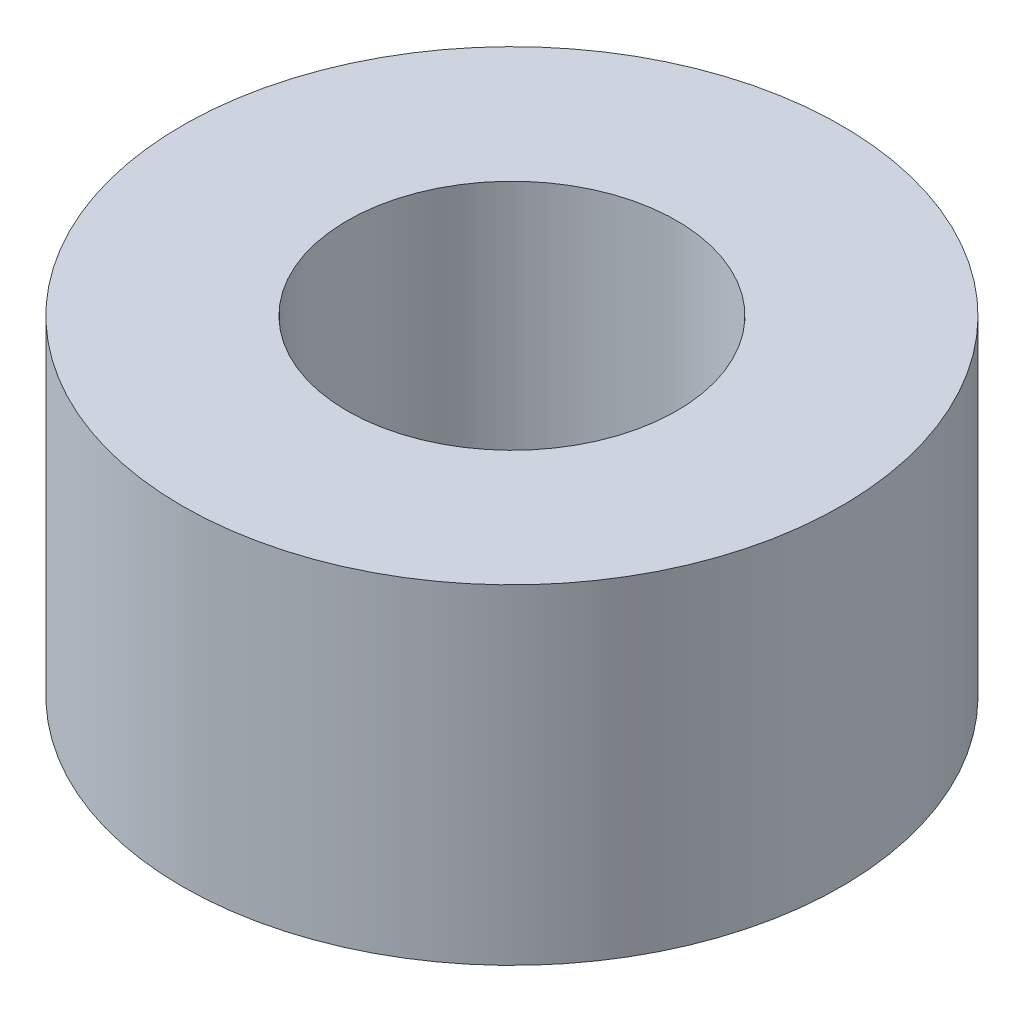
ISO-10303-21;
HEADER;
FILE_DESCRIPTION(('STEP AP214'),'2;1');
FILE_NAME('part.step','',(''),(''),'','','');
FILE_SCHEMA(('AUTOMOTIVE_DESIGN { 1 0 10303 214 1 1 1 1 }'));
ENDSEC;
DATA;
#1=APPLICATION_CONTEXT('core data for automotive mechanical design processes');
#2=APPLICATION_PROTOCOL_DEFINITION('international standard','automotive_design',2000,#1);
#3=PRODUCT_CONTEXT('',#1,'mechanical');
#4=PRODUCT('Part','Part','',(#3));
#5=PRODUCT_RELATED_PRODUCT_CATEGORY('part','',(#4));
#6=PRODUCT_DEFINITION_FORMATION('','',#4);
#7=PRODUCT_DEFINITION_CONTEXT('part definition',#1,'design');
#8=PRODUCT_DEFINITION('design','',#6,#7);
#9=PRODUCT_DEFINITION_SHAPE('','',#8);
#10=(LENGTH_UNIT() NAMED_UNIT(*) SI_UNIT(.MILLI.,.METRE.));
#11=(NAMED_UNIT(*) PLANE_ANGLE_UNIT() SI_UNIT($,.RADIAN.));
#12=(NAMED_UNIT(*) SI_UNIT($,.STERADIAN.) SOLID_ANGLE_UNIT());
#13=UNCERTAINTY_MEASURE_WITH_UNIT(LENGTH_MEASURE(1.E-05),#10,'distance_accuracy_value','');
#14=(GEOMETRIC_REPRESENTATION_CONTEXT(3) GLOBAL_UNCERTAINTY_ASSIGNED_CONTEXT((#13)) GLOBAL_UNIT_ASSIGNED_CONTEXT((#10,
#11,#12)) REPRESENTATION_CONTEXT('',''));
#15=CARTESIAN_POINT('',(0.,0.,0.));
#16=DIRECTION('',(0.,0.,1.));
#17=DIRECTION('',(1.,0.,0.));
#18=AXIS2_PLACEMENT_3D('',#15,#16,#17);
#19=CARTESIAN_POINT('',(0.,2.,0.));
#20=DIRECTION('',(0.,1.,0.));
#21=DIRECTION('',(0.,0.,1.));
#22=AXIS2_PLACEMENT_3D('',#19,#20,#21);
#23=PLANE('',#22);
#24=CARTESIAN_POINT('',(0.,2.,0.));
#25=DIRECTION('',(0.,1.,0.));
#26=DIRECTION('',(0.,0.,1.));
#27=AXIS2_PLACEMENT_3D('',#24,#25,#26);
#28=CIRCLE('',#27,2.);
#29=CARTESIAN_POINT('',(0.,2.,2.));
#30=VERTEX_POINT('',#29);
#31=EDGE_CURVE('E10',#30,#30,#28,.T.);
#32=ORIENTED_EDGE('',*,*,#31,.T.);
#33=EDGE_LOOP('',(#32));
#34=FACE_BOUND('',#33,.T.);
#35=CARTESIAN_POINT('',(0.,2.,0.));
#36=DIRECTION('',(0.,1.,0.));
#37=DIRECTION('',(0.,0.,1.));
#38=AXIS2_PLACEMENT_3D('',#35,#36,#37);
#39=CIRCLE('',#38,1.);
#40=CARTESIAN_POINT('',(0.,2.,1.));
#41=VERTEX_POINT('',#40);
#42=EDGE_CURVE('E46',#41,#41,#39,.T.);
#43=ORIENTED_EDGE('',*,*,#42,.F.);
#44=EDGE_LOOP('',(#43));
#45=FACE_BOUND('',#44,.T.);
#46=ADVANCED_FACE('F35',(#34,#45),#23,.T.);
#47=CARTESIAN_POINT('',(0.,0.,0.));
#48=DIRECTION('',(0.,1.,0.));
#49=DIRECTION('',(0.,0.,1.));
#50=AXIS2_PLACEMENT_3D('',#47,#48,#49);
#51=PLANE('',#50);
#52=CARTESIAN_POINT('',(0.,0.,0.));
#53=DIRECTION('',(0.,1.,0.));
#54=DIRECTION('',(0.,0.,1.));
#55=AXIS2_PLACEMENT_3D('',#52,#53,#54);
#56=CIRCLE('',#55,2.);
#57=CARTESIAN_POINT('',(0.,0.,2.));
#58=VERTEX_POINT('',#57);
#59=EDGE_CURVE('E39',#58,#58,#56,.T.);
#60=ORIENTED_EDGE('',*,*,#59,.F.);
#61=EDGE_LOOP('',(#60));
#62=FACE_BOUND('',#61,.T.);
#63=CARTESIAN_POINT('',(0.,0.,0.));
#64=DIRECTION('',(0.,1.,0.));
#65=DIRECTION('',(0.,0.,1.));
#66=AXIS2_PLACEMENT_3D('',#63,#64,#65);
#67=CIRCLE('',#66,1.);
#68=CARTESIAN_POINT('',(0.,0.,1.));
#69=VERTEX_POINT('',#68);
#70=EDGE_CURVE('E48',#69,#69,#67,.T.);
#71=ORIENTED_EDGE('',*,*,#70,.T.);
#72=EDGE_LOOP('',(#71));
#73=FACE_BOUND('',#72,.T.);
#74=ADVANCED_FACE('F58',(#62,#73),#51,.F.);
#75=CARTESIAN_POINT('',(0.,2.,0.));
#76=DIRECTION('',(0.,-1.,0.));
#77=DIRECTION('',(0.,0.,-1.));
#78=AXIS2_PLACEMENT_3D('',#75,#76,#77);
#79=CYLINDRICAL_SURFACE('',#78,2.);
#80=ORIENTED_EDGE('',*,*,#31,.F.);
#81=EDGE_LOOP('',(#80));
#82=FACE_BOUND('',#81,.T.);
#83=ORIENTED_EDGE('',*,*,#59,.T.);
#84=EDGE_LOOP('',(#83));
#85=FACE_BOUND('',#84,.T.);
#86=ADVANCED_FACE('F37',(#82,#85),#79,.T.);
#87=CARTESIAN_POINT('',(0.,2.,0.));
#88=DIRECTION('',(0.,-1.,0.));
#89=DIRECTION('',(0.,0.,-1.));
#90=AXIS2_PLACEMENT_3D('',#87,#88,#89);
#91=CYLINDRICAL_SURFACE('',#90,1.);
#92=ORIENTED_EDGE('',*,*,#42,.T.);
#93=EDGE_LOOP('',(#92));
#94=FACE_BOUND('',#93,.T.);
#95=ORIENTED_EDGE('',*,*,#70,.F.);
#96=EDGE_LOOP('',(#95));
#97=FACE_BOUND('',#96,.T.);
#98=ADVANCED_FACE('F54',(#94,#97),#91,.F.);
#99=CLOSED_SHELL('',(#46,#74,#86,#98));
#100=MANIFOLD_SOLID_BREP('B2',#99);
#101=ADVANCED_BREP_SHAPE_REPRESENTATION('',(#18,#100),#14);
#102=SHAPE_DEFINITION_REPRESENTATION(#9,#101);
ENDSEC;
END-ISO-10303-21;
